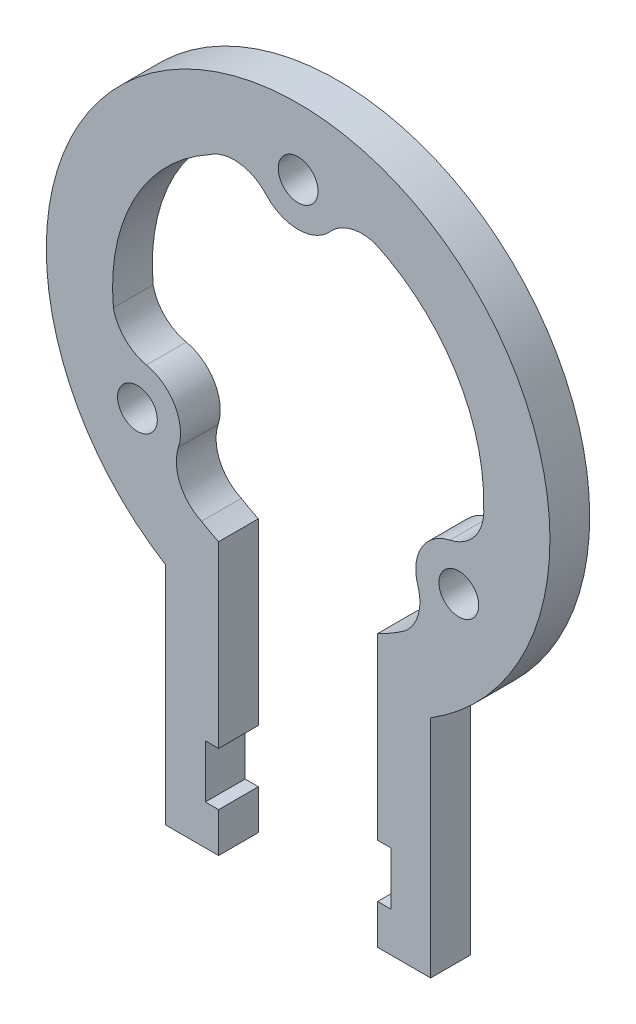
ISO-10303-21;
HEADER;
FILE_DESCRIPTION(('STEP AP214'),'2;1');
FILE_NAME('part.step','',(''),(''),'','','');
FILE_SCHEMA(('AUTOMOTIVE_DESIGN { 1 0 10303 214 1 1 1 1 }'));
ENDSEC;
DATA;
#1=APPLICATION_CONTEXT('core data for automotive mechanical design processes');
#2=APPLICATION_PROTOCOL_DEFINITION('international standard','automotive_design',2000,#1);
#3=PRODUCT_CONTEXT('',#1,'mechanical');
#4=PRODUCT('Part','Part','',(#3));
#5=PRODUCT_RELATED_PRODUCT_CATEGORY('part','',(#4));
#6=PRODUCT_DEFINITION_FORMATION('','',#4);
#7=PRODUCT_DEFINITION_CONTEXT('part definition',#1,'design');
#8=PRODUCT_DEFINITION('design','',#6,#7);
#9=PRODUCT_DEFINITION_SHAPE('','',#8);
#10=(LENGTH_UNIT() NAMED_UNIT(*) SI_UNIT(.MILLI.,.METRE.));
#11=(NAMED_UNIT(*) PLANE_ANGLE_UNIT() SI_UNIT($,.RADIAN.));
#12=(NAMED_UNIT(*) SI_UNIT($,.STERADIAN.) SOLID_ANGLE_UNIT());
#13=UNCERTAINTY_MEASURE_WITH_UNIT(LENGTH_MEASURE(1.E-05),#10,'distance_accuracy_value','');
#14=(GEOMETRIC_REPRESENTATION_CONTEXT(3) GLOBAL_UNCERTAINTY_ASSIGNED_CONTEXT((#13)) GLOBAL_UNIT_ASSIGNED_CONTEXT((#10,
#11,#12)) REPRESENTATION_CONTEXT('',''));
#15=CARTESIAN_POINT('',(0.,0.,0.));
#16=DIRECTION('',(0.,0.,1.));
#17=DIRECTION('',(1.,0.,0.));
#18=AXIS2_PLACEMENT_3D('',#15,#16,#17);
#19=CARTESIAN_POINT('',(0.,0.,3.));
#20=DIRECTION('',(0.,0.,1.));
#21=DIRECTION('',(1.,0.,0.));
#22=AXIS2_PLACEMENT_3D('',#19,#20,#21);
#23=PLANE('',#22);
#24=CARTESIAN_POINT('',(12.124355652982,-7.00000000000017,3.));
#25=DIRECTION('',(0.,0.,1.));
#26=DIRECTION('',(1.,0.,0.));
#27=AXIS2_PLACEMENT_3D('',#24,#25,#26);
#28=CIRCLE('',#27,1.50000000000007);
#29=CARTESIAN_POINT('',(13.6243556529821,-7.00000000000017,3.));
#30=VERTEX_POINT('',#29);
#31=EDGE_CURVE('E493',#30,#30,#28,.T.);
#32=ORIENTED_EDGE('',*,*,#31,.F.);
#33=EDGE_LOOP('',(#32));
#34=FACE_BOUND('',#33,.T.);
#35=DIRECTION('',(-1.,0.,0.));
#36=VECTOR('',#35,1.);
#37=CARTESIAN_POINT('',(-7.0000000000001,-30.1554944214036,3.));
#38=LINE('',#37,#36);
#39=CARTESIAN_POINT('',(-6.0000000000001,-30.1554944214036,3.));
#40=VERTEX_POINT('',#39);
#41=CARTESIAN_POINT('',(-7.0000000000001,-30.1554944214036,3.));
#42=VERTEX_POINT('',#41);
#43=EDGE_CURVE('E304',#40,#42,#38,.T.);
#44=ORIENTED_EDGE('',*,*,#43,.T.);
#45=DIRECTION('',(0.,1.,0.));
#46=VECTOR('',#45,1.);
#47=CARTESIAN_POINT('',(-7.00000000000009,-26.1554944214036,3.));
#48=LINE('',#47,#46);
#49=CARTESIAN_POINT('',(-7.00000000000009,-26.1554944214036,3.));
#50=VERTEX_POINT('',#49);
#51=EDGE_CURVE('E152',#42,#50,#48,.T.);
#52=ORIENTED_EDGE('',*,*,#51,.T.);
#53=DIRECTION('',(1.,0.,0.));
#54=VECTOR('',#53,1.);
#55=CARTESIAN_POINT('',(-7.00000000000009,-26.1554944214036,3.));
#56=LINE('',#55,#54);
#57=CARTESIAN_POINT('',(-6.00000000000009,-26.1554944214036,3.));
#58=VERTEX_POINT('',#57);
#59=EDGE_CURVE('E379',#50,#58,#56,.T.);
#60=ORIENTED_EDGE('',*,*,#59,.T.);
#61=DIRECTION('',(0.,1.,0.));
#62=VECTOR('',#61,1.);
#63=CARTESIAN_POINT('',(-6.00000000000009,-26.1554944214036,3.));
#64=LINE('',#63,#62);
#65=CARTESIAN_POINT('',(-6.0000000000001,-12.6491106406735,3.));
#66=VERTEX_POINT('',#65);
#67=EDGE_CURVE('E398',#58,#66,#64,.T.);
#68=ORIENTED_EDGE('',*,*,#67,.T.);
#69=CARTESIAN_POINT('',(0.,0.,3.));
#70=DIRECTION('',(0.,0.,-1.));
#71=DIRECTION('',(1.,0.,0.));
#72=AXIS2_PLACEMENT_3D('',#69,#70,#71);
#73=CIRCLE('',#72,14.);
#74=CARTESIAN_POINT('',(-7.28860608140232,-11.9530841789952,3.));
#75=VERTEX_POINT('',#74);
#76=EDGE_CURVE('E395',#66,#75,#73,.T.);
#77=ORIENTED_EDGE('',*,*,#76,.T.);
#78=CARTESIAN_POINT('',(-5.93863769378334,-8.99672064376658,3.));
#79=DIRECTION('',(0.,0.,-1.));
#80=DIRECTION('',(1.,0.,0.));
#81=AXIS2_PLACEMENT_3D('',#78,#79,#80);
#82=CIRCLE('',#81,3.25);
#83=CARTESIAN_POINT('',(-9.03149667338279,-7.9983603218832,3.));
#84=VERTEX_POINT('',#83);
#85=EDGE_CURVE('E397',#75,#84,#82,.T.);
#86=ORIENTED_EDGE('',*,*,#85,.T.);
#87=CARTESIAN_POINT('',(-12.1243556529822,-6.99999999999983,3.));
#88=DIRECTION('',(0.,0.,1.));
#89=DIRECTION('',(1.,0.,0.));
#90=AXIS2_PLACEMENT_3D('',#87,#88,#89);
#91=CIRCLE('',#90,3.25);
#92=CARTESIAN_POINT('',(-11.4425315640638,-3.82232539240223,3.));
#93=VERTEX_POINT('',#92);
#94=EDGE_CURVE('E400',#84,#93,#91,.T.);
#95=ORIENTED_EDGE('',*,*,#94,.T.);
#96=CARTESIAN_POINT('',(-10.7607074751454,-0.644650784804622,3.));
#97=DIRECTION('',(0.,0.,-1.));
#98=DIRECTION('',(1.,0.,0.));
#99=AXIS2_PLACEMENT_3D('',#96,#97,#98);
#100=CIRCLE('',#99,3.25);
#101=CARTESIAN_POINT('',(-13.9359386105091,-1.33776494352389,3.));
#102=VERTEX_POINT('',#101);
#103=EDGE_CURVE('E406',#93,#102,#100,.T.);
#104=ORIENTED_EDGE('',*,*,#103,.T.);
#105=CARTESIAN_POINT('',(0.,0.,3.));
#106=DIRECTION('',(0.,0.,-1.));
#107=DIRECTION('',(1.,0.,0.));
#108=AXIS2_PLACEMENT_3D('',#105,#106,#107);
#109=CIRCLE('',#108,14.);
#110=CARTESIAN_POINT('',(-6.70737151188253,12.2886601141698,3.));
#111=VERTEX_POINT('',#110);
#112=EDGE_CURVE('E408',#102,#111,#109,.T.);
#113=ORIENTED_EDGE('',*,*,#112,.T.);
#114=CARTESIAN_POINT('',(-4.82206978136206,9.6413714285715,3.));
#115=DIRECTION('',(0.,0.,-1.));
#116=DIRECTION('',(1.,0.,0.));
#117=AXIS2_PLACEMENT_3D('',#114,#115,#116);
#118=CIRCLE('',#117,3.25);
#119=CARTESIAN_POINT('',(-2.41103489068093,11.8206857142858,3.));
#120=VERTEX_POINT('',#119);
#121=EDGE_CURVE('E410',#111,#120,#118,.T.);
#122=ORIENTED_EDGE('',*,*,#121,.T.);
#123=CARTESIAN_POINT('',(2.07934408239977E-13,14.,3.));
#124=DIRECTION('',(0.,0.,1.));
#125=DIRECTION('',(1.,0.,0.));
#126=AXIS2_PLACEMENT_3D('',#123,#124,#125);
#127=CIRCLE('',#126,3.25);
#128=CARTESIAN_POINT('',(2.41103489068127,11.8206857142857,3.));
#129=VERTEX_POINT('',#128);
#130=EDGE_CURVE('E412',#120,#129,#127,.T.);
#131=ORIENTED_EDGE('',*,*,#130,.T.);
#132=CARTESIAN_POINT('',(4.82206978136234,9.64137142857136,3.));
#133=DIRECTION('',(0.,0.,-1.));
#134=DIRECTION('',(1.,0.,0.));
#135=AXIS2_PLACEMENT_3D('',#132,#133,#134);
#136=CIRCLE('',#135,3.25);
#137=CARTESIAN_POINT('',(5.80943087987061,12.7377593340432,3.));
#138=VERTEX_POINT('',#137);
#139=EDGE_CURVE('E414',#129,#138,#136,.T.);
#140=ORIENTED_EDGE('',*,*,#139,.T.);
#141=CARTESIAN_POINT('',(0.,0.,3.));
#142=DIRECTION('',(0.,0.,-1.));
#143=DIRECTION('',(1.,0.,0.));
#144=AXIS2_PLACEMENT_3D('',#141,#142,#143);
#145=CIRCLE('',#144,14.);
#146=CARTESIAN_POINT('',(13.9959775932849,-0.335575935174566,3.));
#147=VERTEX_POINT('',#146);
#148=EDGE_CURVE('E416',#138,#147,#145,.T.);
#149=ORIENTED_EDGE('',*,*,#148,.T.);
#150=CARTESIAN_POINT('',(10.7607074751454,-0.644650784804921,3.));
#151=DIRECTION('',(0.,0.,-1.));
#152=DIRECTION('',(1.,0.,0.));
#153=AXIS2_PLACEMENT_3D('',#150,#151,#152);
#154=CIRCLE('',#153,3.25);
#155=CARTESIAN_POINT('',(11.4425315640637,-3.82232539240255,3.));
#156=VERTEX_POINT('',#155);
#157=EDGE_CURVE('E418',#147,#156,#154,.T.);
#158=ORIENTED_EDGE('',*,*,#157,.T.);
#159=CARTESIAN_POINT('',(12.124355652982,-7.00000000000017,3.));
#160=DIRECTION('',(0.,0.,1.));
#161=DIRECTION('',(1.,0.,0.));
#162=AXIS2_PLACEMENT_3D('',#159,#160,#161);
#163=CIRCLE('',#162,3.25);
#164=CARTESIAN_POINT('',(9.03149667338257,-7.99836032188346,3.));
#165=VERTEX_POINT('',#164);
#166=EDGE_CURVE('E420',#156,#165,#163,.T.);
#167=ORIENTED_EDGE('',*,*,#166,.T.);
#168=CARTESIAN_POINT('',(5.93863769378309,-8.99672064376674,3.));
#169=DIRECTION('',(0.,0.,-1.));
#170=DIRECTION('',(1.,0.,0.));
#171=AXIS2_PLACEMENT_3D('',#168,#169,#170);
#172=CIRCLE('',#171,3.25);
#173=CARTESIAN_POINT('',(8.12650773063849,-11.3999943905194,3.));
#174=VERTEX_POINT('',#173);
#175=EDGE_CURVE('E422',#165,#174,#172,.T.);
#176=ORIENTED_EDGE('',*,*,#175,.T.);
#177=CARTESIAN_POINT('',(0.,0.,3.));
#178=DIRECTION('',(0.,0.,-1.));
#179=DIRECTION('',(1.,0.,0.));
#180=AXIS2_PLACEMENT_3D('',#177,#178,#179);
#181=CIRCLE('',#180,14.);
#182=CARTESIAN_POINT('',(5.9999999999999,-12.6491106406736,3.));
#183=VERTEX_POINT('',#182);
#184=EDGE_CURVE('E424',#174,#183,#181,.T.);
#185=ORIENTED_EDGE('',*,*,#184,.T.);
#186=DIRECTION('',(0.,-1.,0.));
#187=VECTOR('',#186,1.);
#188=CARTESIAN_POINT('',(5.99999999999991,-26.1554944214036,3.));
#189=LINE('',#188,#187);
#190=CARTESIAN_POINT('',(5.99999999999991,-26.1554944214036,3.));
#191=VERTEX_POINT('',#190);
#192=EDGE_CURVE('E426',#183,#191,#189,.T.);
#193=ORIENTED_EDGE('',*,*,#192,.T.);
#194=DIRECTION('',(1.,0.,0.));
#195=VECTOR('',#194,1.);
#196=CARTESIAN_POINT('',(5.99999999999991,-26.1554944214036,3.));
#197=LINE('',#196,#195);
#198=CARTESIAN_POINT('',(6.99999999999991,-26.1554944214036,3.));
#199=VERTEX_POINT('',#198);
#200=EDGE_CURVE('E428',#191,#199,#197,.T.);
#201=ORIENTED_EDGE('',*,*,#200,.T.);
#202=DIRECTION('',(0.,-1.,0.));
#203=VECTOR('',#202,1.);
#204=CARTESIAN_POINT('',(6.99999999999991,-26.1554944214036,3.));
#205=LINE('',#204,#203);
#206=CARTESIAN_POINT('',(6.9999999999999,-30.1554944214036,3.));
#207=VERTEX_POINT('',#206);
#208=EDGE_CURVE('E430',#199,#207,#205,.T.);
#209=ORIENTED_EDGE('',*,*,#208,.T.);
#210=DIRECTION('',(-1.,0.,0.));
#211=VECTOR('',#210,1.);
#212=CARTESIAN_POINT('',(5.9999999999999,-30.1554944214036,3.));
#213=LINE('',#212,#211);
#214=CARTESIAN_POINT('',(5.9999999999999,-30.1554944214036,3.));
#215=VERTEX_POINT('',#214);
#216=EDGE_CURVE('E432',#207,#215,#213,.T.);
#217=ORIENTED_EDGE('',*,*,#216,.T.);
#218=DIRECTION('',(0.,-1.,0.));
#219=VECTOR('',#218,1.);
#220=CARTESIAN_POINT('',(5.9999999999999,-33.1554944214036,3.));
#221=LINE('',#220,#219);
#222=CARTESIAN_POINT('',(5.9999999999999,-33.1554944214036,3.));
#223=VERTEX_POINT('',#222);
#224=EDGE_CURVE('E434',#215,#223,#221,.T.);
#225=ORIENTED_EDGE('',*,*,#224,.T.);
#226=DIRECTION('',(1.,0.,0.));
#227=VECTOR('',#226,1.);
#228=CARTESIAN_POINT('',(9.9999999999999,-33.1554944214036,3.));
#229=LINE('',#228,#227);
#230=CARTESIAN_POINT('',(9.9999999999999,-33.1554944214036,3.));
#231=VERTEX_POINT('',#230);
#232=EDGE_CURVE('E436',#223,#231,#229,.T.);
#233=ORIENTED_EDGE('',*,*,#232,.T.);
#234=DIRECTION('',(0.,1.,0.));
#235=VECTOR('',#234,1.);
#236=CARTESIAN_POINT('',(9.9999999999999,-16.1554944214036,3.));
#237=LINE('',#236,#235);
#238=CARTESIAN_POINT('',(9.9999999999999,-16.1554944214036,3.));
#239=VERTEX_POINT('',#238);
#240=EDGE_CURVE('E438',#231,#239,#237,.T.);
#241=ORIENTED_EDGE('',*,*,#240,.T.);
#242=CARTESIAN_POINT('',(0.,0.,3.));
#243=DIRECTION('',(0.,0.,1.));
#244=DIRECTION('',(1.,0.,0.));
#245=AXIS2_PLACEMENT_3D('',#242,#243,#244);
#246=CIRCLE('',#245,19.);
#247=CARTESIAN_POINT('',(-10.0000000000001,-16.1554944214034,3.));
#248=VERTEX_POINT('',#247);
#249=EDGE_CURVE('E231',#239,#248,#246,.T.);
#250=ORIENTED_EDGE('',*,*,#249,.T.);
#251=DIRECTION('',(0.,-1.,0.));
#252=VECTOR('',#251,1.);
#253=CARTESIAN_POINT('',(-10.0000000000001,-16.1554944214034,3.));
#254=LINE('',#253,#252);
#255=CARTESIAN_POINT('',(-10.0000000000001,-33.1554944214036,3.));
#256=VERTEX_POINT('',#255);
#257=EDGE_CURVE('E225',#248,#256,#254,.T.);
#258=ORIENTED_EDGE('',*,*,#257,.T.);
#259=DIRECTION('',(1.,0.,0.));
#260=VECTOR('',#259,1.);
#261=CARTESIAN_POINT('',(-6.0000000000001,-33.1554944214036,3.));
#262=LINE('',#261,#260);
#263=CARTESIAN_POINT('',(-6.0000000000001,-33.1554944214036,3.));
#264=VERTEX_POINT('',#263);
#265=EDGE_CURVE('E229',#256,#264,#262,.T.);
#266=ORIENTED_EDGE('',*,*,#265,.T.);
#267=DIRECTION('',(0.,1.,0.));
#268=VECTOR('',#267,1.);
#269=CARTESIAN_POINT('',(-6.0000000000001,-33.1554944214036,3.));
#270=LINE('',#269,#268);
#271=EDGE_CURVE('E49',#264,#40,#270,.T.);
#272=ORIENTED_EDGE('',*,*,#271,.T.);
#273=EDGE_LOOP('',(#44,#52,#60,#68,#77,#86,#95,#104,#113,#122,#131,#140,#149,#158,#167,#176,
#185,#193,#201,#209,#217,#225,#233,#241,#250,#258,#266,#272));
#274=FACE_BOUND('',#273,.T.);
#275=CARTESIAN_POINT('',(2.07934408239977E-13,14.,3.));
#276=DIRECTION('',(0.,0.,1.));
#277=DIRECTION('',(1.,0.,0.));
#278=AXIS2_PLACEMENT_3D('',#275,#276,#277);
#279=CIRCLE('',#278,1.5);
#280=CARTESIAN_POINT('',(1.50000000000021,14.,3.));
#281=VERTEX_POINT('',#280);
#282=EDGE_CURVE('E253',#281,#281,#279,.T.);
#283=ORIENTED_EDGE('',*,*,#282,.F.);
#284=EDGE_LOOP('',(#283));
#285=FACE_BOUND('',#284,.T.);
#286=CARTESIAN_POINT('',(-12.1243556529822,-6.99999999999983,3.));
#287=DIRECTION('',(0.,0.,1.));
#288=DIRECTION('',(1.,0.,0.));
#289=AXIS2_PLACEMENT_3D('',#286,#287,#288);
#290=CIRCLE('',#289,1.5);
#291=CARTESIAN_POINT('',(-10.6243556529822,-6.99999999999983,3.));
#292=VERTEX_POINT('',#291);
#293=EDGE_CURVE('E484',#292,#292,#290,.T.);
#294=ORIENTED_EDGE('',*,*,#293,.F.);
#295=EDGE_LOOP('',(#294));
#296=FACE_BOUND('',#295,.T.);
#297=ADVANCED_FACE('F32',(#34,#274,#285,#296),#23,.T.);
#298=CARTESIAN_POINT('',(0.,0.,0.));
#299=DIRECTION('',(0.,0.,1.));
#300=DIRECTION('',(1.,0.,0.));
#301=AXIS2_PLACEMENT_3D('',#298,#299,#300);
#302=PLANE('',#301);
#303=DIRECTION('',(-1.,0.,0.));
#304=VECTOR('',#303,1.);
#305=CARTESIAN_POINT('',(-7.0000000000001,-30.1554944214036,0.));
#306=LINE('',#305,#304);
#307=CARTESIAN_POINT('',(-6.0000000000001,-30.1554944214036,0.));
#308=VERTEX_POINT('',#307);
#309=CARTESIAN_POINT('',(-7.0000000000001,-30.1554944214036,0.));
#310=VERTEX_POINT('',#309);
#311=EDGE_CURVE('E249',#308,#310,#306,.T.);
#312=ORIENTED_EDGE('',*,*,#311,.F.);
#313=DIRECTION('',(0.,1.,0.));
#314=VECTOR('',#313,1.);
#315=CARTESIAN_POINT('',(-6.0000000000001,-33.1554944214036,0.));
#316=LINE('',#315,#314);
#317=CARTESIAN_POINT('',(-6.0000000000001,-33.1554944214036,0.));
#318=VERTEX_POINT('',#317);
#319=EDGE_CURVE('E144',#318,#308,#316,.T.);
#320=ORIENTED_EDGE('',*,*,#319,.F.);
#321=DIRECTION('',(1.,0.,0.));
#322=VECTOR('',#321,1.);
#323=CARTESIAN_POINT('',(-6.0000000000001,-33.1554944214036,0.));
#324=LINE('',#323,#322);
#325=CARTESIAN_POINT('',(-10.0000000000001,-33.1554944214036,0.));
#326=VERTEX_POINT('',#325);
#327=EDGE_CURVE('E138',#326,#318,#324,.T.);
#328=ORIENTED_EDGE('',*,*,#327,.F.);
#329=DIRECTION('',(0.,-1.,0.));
#330=VECTOR('',#329,1.);
#331=CARTESIAN_POINT('',(-10.0000000000001,-16.1554944214034,0.));
#332=LINE('',#331,#330);
#333=CARTESIAN_POINT('',(-10.0000000000001,-16.1554944214034,0.));
#334=VERTEX_POINT('',#333);
#335=EDGE_CURVE('E239',#334,#326,#332,.T.);
#336=ORIENTED_EDGE('',*,*,#335,.F.);
#337=CARTESIAN_POINT('',(0.,0.,0.));
#338=DIRECTION('',(0.,0.,1.));
#339=DIRECTION('',(1.,0.,0.));
#340=AXIS2_PLACEMENT_3D('',#337,#338,#339);
#341=CIRCLE('',#340,19.);
#342=CARTESIAN_POINT('',(9.9999999999999,-16.1554944214036,0.));
#343=VERTEX_POINT('',#342);
#344=EDGE_CURVE('E299',#343,#334,#341,.T.);
#345=ORIENTED_EDGE('',*,*,#344,.F.);
#346=DIRECTION('',(0.,1.,0.));
#347=VECTOR('',#346,1.);
#348=CARTESIAN_POINT('',(9.9999999999999,-16.1554944214036,0.));
#349=LINE('',#348,#347);
#350=CARTESIAN_POINT('',(9.9999999999999,-33.1554944214036,0.));
#351=VERTEX_POINT('',#350);
#352=EDGE_CURVE('E297',#351,#343,#349,.T.);
#353=ORIENTED_EDGE('',*,*,#352,.F.);
#354=DIRECTION('',(1.,0.,0.));
#355=VECTOR('',#354,1.);
#356=CARTESIAN_POINT('',(9.9999999999999,-33.1554944214036,0.));
#357=LINE('',#356,#355);
#358=CARTESIAN_POINT('',(5.9999999999999,-33.1554944214036,0.));
#359=VERTEX_POINT('',#358);
#360=EDGE_CURVE('E295',#359,#351,#357,.T.);
#361=ORIENTED_EDGE('',*,*,#360,.F.);
#362=DIRECTION('',(0.,-1.,0.));
#363=VECTOR('',#362,1.);
#364=CARTESIAN_POINT('',(5.9999999999999,-33.1554944214036,0.));
#365=LINE('',#364,#363);
#366=CARTESIAN_POINT('',(5.9999999999999,-30.1554944214036,0.));
#367=VERTEX_POINT('',#366);
#368=EDGE_CURVE('E293',#367,#359,#365,.T.);
#369=ORIENTED_EDGE('',*,*,#368,.F.);
#370=DIRECTION('',(-1.,0.,0.));
#371=VECTOR('',#370,1.);
#372=CARTESIAN_POINT('',(5.9999999999999,-30.1554944214036,0.));
#373=LINE('',#372,#371);
#374=CARTESIAN_POINT('',(6.9999999999999,-30.1554944214036,0.));
#375=VERTEX_POINT('',#374);
#376=EDGE_CURVE('E291',#375,#367,#373,.T.);
#377=ORIENTED_EDGE('',*,*,#376,.F.);
#378=DIRECTION('',(0.,-1.,0.));
#379=VECTOR('',#378,1.);
#380=CARTESIAN_POINT('',(6.99999999999991,-26.1554944214036,0.));
#381=LINE('',#380,#379);
#382=CARTESIAN_POINT('',(6.99999999999991,-26.1554944214036,0.));
#383=VERTEX_POINT('',#382);
#384=EDGE_CURVE('E289',#383,#375,#381,.T.);
#385=ORIENTED_EDGE('',*,*,#384,.F.);
#386=DIRECTION('',(1.,0.,0.));
#387=VECTOR('',#386,1.);
#388=CARTESIAN_POINT('',(5.99999999999991,-26.1554944214036,0.));
#389=LINE('',#388,#387);
#390=CARTESIAN_POINT('',(5.99999999999991,-26.1554944214036,0.));
#391=VERTEX_POINT('',#390);
#392=EDGE_CURVE('E287',#391,#383,#389,.T.);
#393=ORIENTED_EDGE('',*,*,#392,.F.);
#394=DIRECTION('',(0.,-1.,0.));
#395=VECTOR('',#394,1.);
#396=CARTESIAN_POINT('',(5.99999999999991,-26.1554944214036,0.));
#397=LINE('',#396,#395);
#398=CARTESIAN_POINT('',(5.9999999999999,-12.6491106406736,0.));
#399=VERTEX_POINT('',#398);
#400=EDGE_CURVE('E285',#399,#391,#397,.T.);
#401=ORIENTED_EDGE('',*,*,#400,.F.);
#402=CARTESIAN_POINT('',(0.,0.,0.));
#403=DIRECTION('',(0.,0.,-1.));
#404=DIRECTION('',(1.,0.,0.));
#405=AXIS2_PLACEMENT_3D('',#402,#403,#404);
#406=CIRCLE('',#405,14.);
#407=CARTESIAN_POINT('',(8.12650773063849,-11.3999943905194,0.));
#408=VERTEX_POINT('',#407);
#409=EDGE_CURVE('E283',#408,#399,#406,.T.);
#410=ORIENTED_EDGE('',*,*,#409,.F.);
#411=CARTESIAN_POINT('',(5.93863769378309,-8.99672064376674,0.));
#412=DIRECTION('',(0.,0.,-1.));
#413=DIRECTION('',(1.,0.,0.));
#414=AXIS2_PLACEMENT_3D('',#411,#412,#413);
#415=CIRCLE('',#414,3.25);
#416=CARTESIAN_POINT('',(9.03149667338257,-7.99836032188346,0.));
#417=VERTEX_POINT('',#416);
#418=EDGE_CURVE('E281',#417,#408,#415,.T.);
#419=ORIENTED_EDGE('',*,*,#418,.F.);
#420=CARTESIAN_POINT('',(12.124355652982,-7.00000000000017,0.));
#421=DIRECTION('',(0.,0.,1.));
#422=DIRECTION('',(1.,0.,0.));
#423=AXIS2_PLACEMENT_3D('',#420,#421,#422);
#424=CIRCLE('',#423,3.25);
#425=CARTESIAN_POINT('',(11.4425315640637,-3.82232539240255,0.));
#426=VERTEX_POINT('',#425);
#427=EDGE_CURVE('E279',#426,#417,#424,.T.);
#428=ORIENTED_EDGE('',*,*,#427,.F.);
#429=CARTESIAN_POINT('',(10.7607074751454,-0.644650784804921,0.));
#430=DIRECTION('',(0.,0.,-1.));
#431=DIRECTION('',(1.,0.,0.));
#432=AXIS2_PLACEMENT_3D('',#429,#430,#431);
#433=CIRCLE('',#432,3.25);
#434=CARTESIAN_POINT('',(13.9959775932849,-0.335575935174566,0.));
#435=VERTEX_POINT('',#434);
#436=EDGE_CURVE('E277',#435,#426,#433,.T.);
#437=ORIENTED_EDGE('',*,*,#436,.F.);
#438=CARTESIAN_POINT('',(0.,0.,0.));
#439=DIRECTION('',(0.,0.,-1.));
#440=DIRECTION('',(1.,0.,0.));
#441=AXIS2_PLACEMENT_3D('',#438,#439,#440);
#442=CIRCLE('',#441,14.);
#443=CARTESIAN_POINT('',(5.80943087987061,12.7377593340432,0.));
#444=VERTEX_POINT('',#443);
#445=EDGE_CURVE('E275',#444,#435,#442,.T.);
#446=ORIENTED_EDGE('',*,*,#445,.F.);
#447=CARTESIAN_POINT('',(4.82206978136234,9.64137142857136,0.));
#448=DIRECTION('',(0.,0.,-1.));
#449=DIRECTION('',(1.,0.,0.));
#450=AXIS2_PLACEMENT_3D('',#447,#448,#449);
#451=CIRCLE('',#450,3.25);
#452=CARTESIAN_POINT('',(2.41103489068127,11.8206857142857,0.));
#453=VERTEX_POINT('',#452);
#454=EDGE_CURVE('E273',#453,#444,#451,.T.);
#455=ORIENTED_EDGE('',*,*,#454,.F.);
#456=CARTESIAN_POINT('',(2.07934408239977E-13,14.,0.));
#457=DIRECTION('',(0.,0.,1.));
#458=DIRECTION('',(1.,0.,0.));
#459=AXIS2_PLACEMENT_3D('',#456,#457,#458);
#460=CIRCLE('',#459,3.25);
#461=CARTESIAN_POINT('',(-2.41103489068093,11.8206857142858,0.));
#462=VERTEX_POINT('',#461);
#463=EDGE_CURVE('E271',#462,#453,#460,.T.);
#464=ORIENTED_EDGE('',*,*,#463,.F.);
#465=CARTESIAN_POINT('',(-4.82206978136206,9.6413714285715,0.));
#466=DIRECTION('',(0.,0.,-1.));
#467=DIRECTION('',(1.,0.,0.));
#468=AXIS2_PLACEMENT_3D('',#465,#466,#467);
#469=CIRCLE('',#468,3.25);
#470=CARTESIAN_POINT('',(-6.70737151188253,12.2886601141698,0.));
#471=VERTEX_POINT('',#470);
#472=EDGE_CURVE('E269',#471,#462,#469,.T.);
#473=ORIENTED_EDGE('',*,*,#472,.F.);
#474=CARTESIAN_POINT('',(0.,0.,0.));
#475=DIRECTION('',(0.,0.,-1.));
#476=DIRECTION('',(1.,0.,0.));
#477=AXIS2_PLACEMENT_3D('',#474,#475,#476);
#478=CIRCLE('',#477,14.);
#479=CARTESIAN_POINT('',(-13.9359386105091,-1.33776494352389,0.));
#480=VERTEX_POINT('',#479);
#481=EDGE_CURVE('E267',#480,#471,#478,.T.);
#482=ORIENTED_EDGE('',*,*,#481,.F.);
#483=CARTESIAN_POINT('',(-10.7607074751454,-0.644650784804622,0.));
#484=DIRECTION('',(0.,0.,-1.));
#485=DIRECTION('',(1.,0.,0.));
#486=AXIS2_PLACEMENT_3D('',#483,#484,#485);
#487=CIRCLE('',#486,3.25);
#488=CARTESIAN_POINT('',(-11.4425315640638,-3.82232539240223,0.));
#489=VERTEX_POINT('',#488);
#490=EDGE_CURVE('E265',#489,#480,#487,.T.);
#491=ORIENTED_EDGE('',*,*,#490,.F.);
#492=CARTESIAN_POINT('',(-12.1243556529822,-6.99999999999983,0.));
#493=DIRECTION('',(0.,0.,1.));
#494=DIRECTION('',(1.,0.,0.));
#495=AXIS2_PLACEMENT_3D('',#492,#493,#494);
#496=CIRCLE('',#495,3.25);
#497=CARTESIAN_POINT('',(-9.03149667338279,-7.9983603218832,0.));
#498=VERTEX_POINT('',#497);
#499=EDGE_CURVE('E263',#498,#489,#496,.T.);
#500=ORIENTED_EDGE('',*,*,#499,.F.);
#501=CARTESIAN_POINT('',(-5.93863769378334,-8.99672064376658,0.));
#502=DIRECTION('',(0.,0.,-1.));
#503=DIRECTION('',(1.,0.,0.));
#504=AXIS2_PLACEMENT_3D('',#501,#502,#503);
#505=CIRCLE('',#504,3.25);
#506=CARTESIAN_POINT('',(-7.28860608140232,-11.9530841789952,0.));
#507=VERTEX_POINT('',#506);
#508=EDGE_CURVE('E261',#507,#498,#505,.T.);
#509=ORIENTED_EDGE('',*,*,#508,.F.);
#510=CARTESIAN_POINT('',(0.,0.,0.));
#511=DIRECTION('',(0.,0.,-1.));
#512=DIRECTION('',(1.,0.,0.));
#513=AXIS2_PLACEMENT_3D('',#510,#511,#512);
#514=CIRCLE('',#513,14.);
#515=CARTESIAN_POINT('',(-6.0000000000001,-12.6491106406735,0.));
#516=VERTEX_POINT('',#515);
#517=EDGE_CURVE('E259',#516,#507,#514,.T.);
#518=ORIENTED_EDGE('',*,*,#517,.F.);
#519=DIRECTION('',(0.,1.,0.));
#520=VECTOR('',#519,1.);
#521=CARTESIAN_POINT('',(-6.00000000000009,-26.1554944214036,0.));
#522=LINE('',#521,#520);
#523=CARTESIAN_POINT('',(-6.00000000000009,-26.1554944214036,0.));
#524=VERTEX_POINT('',#523);
#525=EDGE_CURVE('E257',#524,#516,#522,.T.);
#526=ORIENTED_EDGE('',*,*,#525,.F.);
#527=DIRECTION('',(1.,0.,0.));
#528=VECTOR('',#527,1.);
#529=CARTESIAN_POINT('',(-7.00000000000009,-26.1554944214036,0.));
#530=LINE('',#529,#528);
#531=CARTESIAN_POINT('',(-7.00000000000009,-26.1554944214036,0.));
#532=VERTEX_POINT('',#531);
#533=EDGE_CURVE('E255',#532,#524,#530,.T.);
#534=ORIENTED_EDGE('',*,*,#533,.F.);
#535=DIRECTION('',(0.,1.,0.));
#536=VECTOR('',#535,1.);
#537=CARTESIAN_POINT('',(-7.00000000000009,-26.1554944214036,0.));
#538=LINE('',#537,#536);
#539=EDGE_CURVE('E252',#310,#532,#538,.T.);
#540=ORIENTED_EDGE('',*,*,#539,.F.);
#541=EDGE_LOOP('',(#312,#320,#328,#336,#345,#353,#361,#369,#377,#385,#393,#401,#410,#419,#428,
#437,#446,#455,#464,#473,#482,#491,#500,#509,#518,#526,#534,#540));
#542=FACE_BOUND('',#541,.T.);
#543=CARTESIAN_POINT('',(2.07934408239977E-13,14.,0.));
#544=DIRECTION('',(0.,0.,1.));
#545=DIRECTION('',(1.,0.,0.));
#546=AXIS2_PLACEMENT_3D('',#543,#544,#545);
#547=CIRCLE('',#546,1.5);
#548=CARTESIAN_POINT('',(1.50000000000021,14.,0.));
#549=VERTEX_POINT('',#548);
#550=EDGE_CURVE('E496',#549,#549,#547,.T.);
#551=ORIENTED_EDGE('',*,*,#550,.T.);
#552=EDGE_LOOP('',(#551));
#553=FACE_BOUND('',#552,.T.);
#554=CARTESIAN_POINT('',(12.124355652982,-7.00000000000017,0.));
#555=DIRECTION('',(0.,0.,1.));
#556=DIRECTION('',(1.,0.,0.));
#557=AXIS2_PLACEMENT_3D('',#554,#555,#556);
#558=CIRCLE('',#557,1.50000000000007);
#559=CARTESIAN_POINT('',(13.6243556529821,-7.00000000000017,0.));
#560=VERTEX_POINT('',#559);
#561=EDGE_CURVE('E490',#560,#560,#558,.T.);
#562=ORIENTED_EDGE('',*,*,#561,.T.);
#563=EDGE_LOOP('',(#562));
#564=FACE_BOUND('',#563,.T.);
#565=CARTESIAN_POINT('',(-12.1243556529822,-6.99999999999983,0.));
#566=DIRECTION('',(0.,0.,1.));
#567=DIRECTION('',(1.,0.,0.));
#568=AXIS2_PLACEMENT_3D('',#565,#566,#567);
#569=CIRCLE('',#568,1.5);
#570=CARTESIAN_POINT('',(-10.6243556529822,-6.99999999999983,0.));
#571=VERTEX_POINT('',#570);
#572=EDGE_CURVE('E487',#571,#571,#569,.T.);
#573=ORIENTED_EDGE('',*,*,#572,.T.);
#574=EDGE_LOOP('',(#573));
#575=FACE_BOUND('',#574,.T.);
#576=ADVANCED_FACE('F383',(#542,#553,#564,#575),#302,.F.);
#577=CARTESIAN_POINT('',(-7.0000000000001,-30.1554944214036,3.));
#578=DIRECTION('',(0.,-1.,0.));
#579=DIRECTION('',(0.,0.,-1.));
#580=AXIS2_PLACEMENT_3D('',#577,#578,#579);
#581=PLANE('',#580);
#582=ORIENTED_EDGE('',*,*,#311,.T.);
#583=DIRECTION('',(0.,0.,-1.));
#584=VECTOR('',#583,1.);
#585=CARTESIAN_POINT('',(-7.0000000000001,-30.1554944214036,3.));
#586=LINE('',#585,#584);
#587=EDGE_CURVE('E11',#42,#310,#586,.T.);
#588=ORIENTED_EDGE('',*,*,#587,.F.);
#589=ORIENTED_EDGE('',*,*,#43,.F.);
#590=DIRECTION('',(0.,0.,-1.));
#591=VECTOR('',#590,1.);
#592=CARTESIAN_POINT('',(-6.0000000000001,-30.1554944214036,3.));
#593=LINE('',#592,#591);
#594=EDGE_CURVE('E245',#40,#308,#593,.T.);
#595=ORIENTED_EDGE('',*,*,#594,.T.);
#596=EDGE_LOOP('',(#582,#588,#589,#595));
#597=FACE_BOUND('',#596,.T.);
#598=ADVANCED_FACE('F34',(#597),#581,.F.);
#599=CARTESIAN_POINT('',(-7.00000000000009,-26.1554944214036,3.));
#600=DIRECTION('',(-1.,0.,0.));
#601=DIRECTION('',(0.,-1.,0.));
#602=AXIS2_PLACEMENT_3D('',#599,#600,#601);
#603=PLANE('',#602);
#604=ORIENTED_EDGE('',*,*,#539,.T.);
#605=DIRECTION('',(0.,0.,-1.));
#606=VECTOR('',#605,1.);
#607=CARTESIAN_POINT('',(-7.00000000000009,-26.1554944214036,3.));
#608=LINE('',#607,#606);
#609=EDGE_CURVE('E41',#50,#532,#608,.T.);
#610=ORIENTED_EDGE('',*,*,#609,.F.);
#611=ORIENTED_EDGE('',*,*,#51,.F.);
#612=ORIENTED_EDGE('',*,*,#587,.T.);
#613=EDGE_LOOP('',(#604,#610,#611,#612));
#614=FACE_BOUND('',#613,.T.);
#615=ADVANCED_FACE('F758',(#614),#603,.F.);
#616=CARTESIAN_POINT('',(-7.00000000000009,-26.1554944214036,3.));
#617=DIRECTION('',(0.,1.,0.));
#618=DIRECTION('',(0.,0.,1.));
#619=AXIS2_PLACEMENT_3D('',#616,#617,#618);
#620=PLANE('',#619);
#621=ORIENTED_EDGE('',*,*,#533,.T.);
#622=DIRECTION('',(0.,0.,-1.));
#623=VECTOR('',#622,1.);
#624=CARTESIAN_POINT('',(-6.00000000000009,-26.1554944214036,3.));
#625=LINE('',#624,#623);
#626=EDGE_CURVE('E371',#58,#524,#625,.T.);
#627=ORIENTED_EDGE('',*,*,#626,.F.);
#628=ORIENTED_EDGE('',*,*,#59,.F.);
#629=ORIENTED_EDGE('',*,*,#609,.T.);
#630=EDGE_LOOP('',(#621,#627,#628,#629));
#631=FACE_BOUND('',#630,.T.);
#632=ADVANCED_FACE('F377',(#631),#620,.F.);
#633=CARTESIAN_POINT('',(-6.00000000000009,-26.1554944214036,3.));
#634=DIRECTION('',(-1.,0.,0.));
#635=DIRECTION('',(0.,-1.,0.));
#636=AXIS2_PLACEMENT_3D('',#633,#634,#635);
#637=PLANE('',#636);
#638=ORIENTED_EDGE('',*,*,#525,.T.);
#639=DIRECTION('',(0.,0.,-1.));
#640=VECTOR('',#639,1.);
#641=CARTESIAN_POINT('',(-6.0000000000001,-12.6491106406735,3.));
#642=LINE('',#641,#640);
#643=EDGE_CURVE('E368',#66,#516,#642,.T.);
#644=ORIENTED_EDGE('',*,*,#643,.F.);
#645=ORIENTED_EDGE('',*,*,#67,.F.);
#646=ORIENTED_EDGE('',*,*,#626,.T.);
#647=EDGE_LOOP('',(#638,#644,#645,#646));
#648=FACE_BOUND('',#647,.T.);
#649=ADVANCED_FACE('F389',(#648),#637,.F.);
#650=CARTESIAN_POINT('',(0.,0.,3.));
#651=DIRECTION('',(0.,0.,-1.));
#652=DIRECTION('',(-1.,0.,0.));
#653=AXIS2_PLACEMENT_3D('',#650,#651,#652);
#654=CYLINDRICAL_SURFACE('',#653,14.);
#655=ORIENTED_EDGE('',*,*,#517,.T.);
#656=DIRECTION('',(0.,0.,-1.));
#657=VECTOR('',#656,1.);
#658=CARTESIAN_POINT('',(-7.28860608140232,-11.9530841789952,3.));
#659=LINE('',#658,#657);
#660=EDGE_CURVE('E365',#75,#507,#659,.T.);
#661=ORIENTED_EDGE('',*,*,#660,.F.);
#662=ORIENTED_EDGE('',*,*,#76,.F.);
#663=ORIENTED_EDGE('',*,*,#643,.T.);
#664=EDGE_LOOP('',(#655,#661,#662,#663));
#665=FACE_BOUND('',#664,.T.);
#666=ADVANCED_FACE('F393',(#665),#654,.F.);
#667=CARTESIAN_POINT('',(-5.93863769378334,-8.99672064376658,3.));
#668=DIRECTION('',(0.,0.,-1.));
#669=DIRECTION('',(-1.,0.,0.));
#670=AXIS2_PLACEMENT_3D('',#667,#668,#669);
#671=CYLINDRICAL_SURFACE('',#670,3.25);
#672=ORIENTED_EDGE('',*,*,#508,.T.);
#673=DIRECTION('',(0.,0.,-1.));
#674=VECTOR('',#673,1.);
#675=CARTESIAN_POINT('',(-9.03149667338279,-7.9983603218832,3.));
#676=LINE('',#675,#674);
#677=EDGE_CURVE('E362',#84,#498,#676,.T.);
#678=ORIENTED_EDGE('',*,*,#677,.F.);
#679=ORIENTED_EDGE('',*,*,#85,.F.);
#680=ORIENTED_EDGE('',*,*,#660,.T.);
#681=EDGE_LOOP('',(#672,#678,#679,#680));
#682=FACE_BOUND('',#681,.T.);
#683=ADVANCED_FACE('F723',(#682),#671,.F.);
#684=CARTESIAN_POINT('',(-12.1243556529822,-6.99999999999983,3.));
#685=DIRECTION('',(0.,0.,-1.));
#686=DIRECTION('',(-1.,0.,0.));
#687=AXIS2_PLACEMENT_3D('',#684,#685,#686);
#688=CYLINDRICAL_SURFACE('',#687,3.25);
#689=ORIENTED_EDGE('',*,*,#499,.T.);
#690=DIRECTION('',(0.,0.,-1.));
#691=VECTOR('',#690,1.);
#692=CARTESIAN_POINT('',(-11.4425315640638,-3.82232539240223,3.));
#693=LINE('',#692,#691);
#694=EDGE_CURVE('E359',#93,#489,#693,.T.);
#695=ORIENTED_EDGE('',*,*,#694,.F.);
#696=ORIENTED_EDGE('',*,*,#94,.F.);
#697=ORIENTED_EDGE('',*,*,#677,.T.);
#698=EDGE_LOOP('',(#689,#695,#696,#697));
#699=FACE_BOUND('',#698,.T.);
#700=ADVANCED_FACE('F713',(#699),#688,.T.);
#701=CARTESIAN_POINT('',(-10.7607074751454,-0.644650784804622,3.));
#702=DIRECTION('',(0.,0.,-1.));
#703=DIRECTION('',(-1.,0.,0.));
#704=AXIS2_PLACEMENT_3D('',#701,#702,#703);
#705=CYLINDRICAL_SURFACE('',#704,3.25);
#706=ORIENTED_EDGE('',*,*,#490,.T.);
#707=DIRECTION('',(0.,0.,-1.));
#708=VECTOR('',#707,1.);
#709=CARTESIAN_POINT('',(-13.9359386105091,-1.33776494352389,3.));
#710=LINE('',#709,#708);
#711=EDGE_CURVE('E356',#102,#480,#710,.T.);
#712=ORIENTED_EDGE('',*,*,#711,.F.);
#713=ORIENTED_EDGE('',*,*,#103,.F.);
#714=ORIENTED_EDGE('',*,*,#694,.T.);
#715=EDGE_LOOP('',(#706,#712,#713,#714));
#716=FACE_BOUND('',#715,.T.);
#717=ADVANCED_FACE('F703',(#716),#705,.F.);
#718=CARTESIAN_POINT('',(0.,0.,3.));
#719=DIRECTION('',(0.,0.,-1.));
#720=DIRECTION('',(-1.,0.,0.));
#721=AXIS2_PLACEMENT_3D('',#718,#719,#720);
#722=CYLINDRICAL_SURFACE('',#721,14.);
#723=ORIENTED_EDGE('',*,*,#481,.T.);
#724=DIRECTION('',(0.,0.,-1.));
#725=VECTOR('',#724,1.);
#726=CARTESIAN_POINT('',(-6.70737151188253,12.2886601141698,3.));
#727=LINE('',#726,#725);
#728=EDGE_CURVE('E353',#111,#471,#727,.T.);
#729=ORIENTED_EDGE('',*,*,#728,.F.);
#730=ORIENTED_EDGE('',*,*,#112,.F.);
#731=ORIENTED_EDGE('',*,*,#711,.T.);
#732=EDGE_LOOP('',(#723,#729,#730,#731));
#733=FACE_BOUND('',#732,.T.);
#734=ADVANCED_FACE('F693',(#733),#722,.F.);
#735=CARTESIAN_POINT('',(-4.82206978136206,9.6413714285715,3.));
#736=DIRECTION('',(0.,0.,-1.));
#737=DIRECTION('',(-1.,0.,0.));
#738=AXIS2_PLACEMENT_3D('',#735,#736,#737);
#739=CYLINDRICAL_SURFACE('',#738,3.25);
#740=ORIENTED_EDGE('',*,*,#472,.T.);
#741=DIRECTION('',(0.,0.,-1.));
#742=VECTOR('',#741,1.);
#743=CARTESIAN_POINT('',(-2.41103489068093,11.8206857142858,3.));
#744=LINE('',#743,#742);
#745=EDGE_CURVE('E350',#120,#462,#744,.T.);
#746=ORIENTED_EDGE('',*,*,#745,.F.);
#747=ORIENTED_EDGE('',*,*,#121,.F.);
#748=ORIENTED_EDGE('',*,*,#728,.T.);
#749=EDGE_LOOP('',(#740,#746,#747,#748));
#750=FACE_BOUND('',#749,.T.);
#751=ADVANCED_FACE('F683',(#750),#739,.F.);
#752=CARTESIAN_POINT('',(2.07934408239977E-13,14.,3.));
#753=DIRECTION('',(0.,0.,-1.));
#754=DIRECTION('',(-1.,0.,0.));
#755=AXIS2_PLACEMENT_3D('',#752,#753,#754);
#756=CYLINDRICAL_SURFACE('',#755,3.25);
#757=ORIENTED_EDGE('',*,*,#463,.T.);
#758=DIRECTION('',(0.,0.,-1.));
#759=VECTOR('',#758,1.);
#760=CARTESIAN_POINT('',(2.41103489068127,11.8206857142857,3.));
#761=LINE('',#760,#759);
#762=EDGE_CURVE('E347',#129,#453,#761,.T.);
#763=ORIENTED_EDGE('',*,*,#762,.F.);
#764=ORIENTED_EDGE('',*,*,#130,.F.);
#765=ORIENTED_EDGE('',*,*,#745,.T.);
#766=EDGE_LOOP('',(#757,#763,#764,#765));
#767=FACE_BOUND('',#766,.T.);
#768=ADVANCED_FACE('F673',(#767),#756,.T.);
#769=CARTESIAN_POINT('',(4.82206978136234,9.64137142857136,3.));
#770=DIRECTION('',(0.,0.,-1.));
#771=DIRECTION('',(-1.,0.,0.));
#772=AXIS2_PLACEMENT_3D('',#769,#770,#771);
#773=CYLINDRICAL_SURFACE('',#772,3.25);
#774=ORIENTED_EDGE('',*,*,#454,.T.);
#775=DIRECTION('',(0.,0.,-1.));
#776=VECTOR('',#775,1.);
#777=CARTESIAN_POINT('',(5.80943087987061,12.7377593340432,3.));
#778=LINE('',#777,#776);
#779=EDGE_CURVE('E344',#138,#444,#778,.T.);
#780=ORIENTED_EDGE('',*,*,#779,.F.);
#781=ORIENTED_EDGE('',*,*,#139,.F.);
#782=ORIENTED_EDGE('',*,*,#762,.T.);
#783=EDGE_LOOP('',(#774,#780,#781,#782));
#784=FACE_BOUND('',#783,.T.);
#785=ADVANCED_FACE('F663',(#784),#773,.F.);
#786=CARTESIAN_POINT('',(0.,0.,3.));
#787=DIRECTION('',(0.,0.,-1.));
#788=DIRECTION('',(-1.,0.,0.));
#789=AXIS2_PLACEMENT_3D('',#786,#787,#788);
#790=CYLINDRICAL_SURFACE('',#789,14.);
#791=ORIENTED_EDGE('',*,*,#445,.T.);
#792=DIRECTION('',(0.,0.,-1.));
#793=VECTOR('',#792,1.);
#794=CARTESIAN_POINT('',(13.9959775932849,-0.335575935174566,3.));
#795=LINE('',#794,#793);
#796=EDGE_CURVE('E341',#147,#435,#795,.T.);
#797=ORIENTED_EDGE('',*,*,#796,.F.);
#798=ORIENTED_EDGE('',*,*,#148,.F.);
#799=ORIENTED_EDGE('',*,*,#779,.T.);
#800=EDGE_LOOP('',(#791,#797,#798,#799));
#801=FACE_BOUND('',#800,.T.);
#802=ADVANCED_FACE('F653',(#801),#790,.F.);
#803=CARTESIAN_POINT('',(10.7607074751454,-0.644650784804921,3.));
#804=DIRECTION('',(0.,0.,-1.));
#805=DIRECTION('',(-1.,0.,0.));
#806=AXIS2_PLACEMENT_3D('',#803,#804,#805);
#807=CYLINDRICAL_SURFACE('',#806,3.25);
#808=ORIENTED_EDGE('',*,*,#436,.T.);
#809=DIRECTION('',(0.,0.,-1.));
#810=VECTOR('',#809,1.);
#811=CARTESIAN_POINT('',(11.4425315640637,-3.82232539240255,3.));
#812=LINE('',#811,#810);
#813=EDGE_CURVE('E338',#156,#426,#812,.T.);
#814=ORIENTED_EDGE('',*,*,#813,.F.);
#815=ORIENTED_EDGE('',*,*,#157,.F.);
#816=ORIENTED_EDGE('',*,*,#796,.T.);
#817=EDGE_LOOP('',(#808,#814,#815,#816));
#818=FACE_BOUND('',#817,.T.);
#819=ADVANCED_FACE('F643',(#818),#807,.F.);
#820=CARTESIAN_POINT('',(12.124355652982,-7.00000000000017,3.));
#821=DIRECTION('',(0.,0.,-1.));
#822=DIRECTION('',(-1.,0.,0.));
#823=AXIS2_PLACEMENT_3D('',#820,#821,#822);
#824=CYLINDRICAL_SURFACE('',#823,3.25);
#825=ORIENTED_EDGE('',*,*,#427,.T.);
#826=DIRECTION('',(0.,0.,-1.));
#827=VECTOR('',#826,1.);
#828=CARTESIAN_POINT('',(9.03149667338257,-7.99836032188346,3.));
#829=LINE('',#828,#827);
#830=EDGE_CURVE('E335',#165,#417,#829,.T.);
#831=ORIENTED_EDGE('',*,*,#830,.F.);
#832=ORIENTED_EDGE('',*,*,#166,.F.);
#833=ORIENTED_EDGE('',*,*,#813,.T.);
#834=EDGE_LOOP('',(#825,#831,#832,#833));
#835=FACE_BOUND('',#834,.T.);
#836=ADVANCED_FACE('F633',(#835),#824,.T.);
#837=CARTESIAN_POINT('',(5.93863769378309,-8.99672064376674,3.));
#838=DIRECTION('',(0.,0.,-1.));
#839=DIRECTION('',(-1.,0.,0.));
#840=AXIS2_PLACEMENT_3D('',#837,#838,#839);
#841=CYLINDRICAL_SURFACE('',#840,3.25);
#842=ORIENTED_EDGE('',*,*,#418,.T.);
#843=DIRECTION('',(0.,0.,-1.));
#844=VECTOR('',#843,1.);
#845=CARTESIAN_POINT('',(8.12650773063849,-11.3999943905194,3.));
#846=LINE('',#845,#844);
#847=EDGE_CURVE('E332',#174,#408,#846,.T.);
#848=ORIENTED_EDGE('',*,*,#847,.F.);
#849=ORIENTED_EDGE('',*,*,#175,.F.);
#850=ORIENTED_EDGE('',*,*,#830,.T.);
#851=EDGE_LOOP('',(#842,#848,#849,#850));
#852=FACE_BOUND('',#851,.T.);
#853=ADVANCED_FACE('F623',(#852),#841,.F.);
#854=CARTESIAN_POINT('',(0.,0.,3.));
#855=DIRECTION('',(0.,0.,-1.));
#856=DIRECTION('',(-1.,0.,0.));
#857=AXIS2_PLACEMENT_3D('',#854,#855,#856);
#858=CYLINDRICAL_SURFACE('',#857,14.);
#859=ORIENTED_EDGE('',*,*,#409,.T.);
#860=DIRECTION('',(0.,0.,-1.));
#861=VECTOR('',#860,1.);
#862=CARTESIAN_POINT('',(5.9999999999999,-12.6491106406736,3.));
#863=LINE('',#862,#861);
#864=EDGE_CURVE('E329',#183,#399,#863,.T.);
#865=ORIENTED_EDGE('',*,*,#864,.F.);
#866=ORIENTED_EDGE('',*,*,#184,.F.);
#867=ORIENTED_EDGE('',*,*,#847,.T.);
#868=EDGE_LOOP('',(#859,#865,#866,#867));
#869=FACE_BOUND('',#868,.T.);
#870=ADVANCED_FACE('F613',(#869),#858,.F.);
#871=CARTESIAN_POINT('',(5.99999999999991,-26.1554944214036,3.));
#872=DIRECTION('',(1.,0.,0.));
#873=DIRECTION('',(0.,1.,0.));
#874=AXIS2_PLACEMENT_3D('',#871,#872,#873);
#875=PLANE('',#874);
#876=ORIENTED_EDGE('',*,*,#400,.T.);
#877=DIRECTION('',(0.,0.,-1.));
#878=VECTOR('',#877,1.);
#879=CARTESIAN_POINT('',(5.99999999999991,-26.1554944214036,3.));
#880=LINE('',#879,#878);
#881=EDGE_CURVE('E326',#191,#391,#880,.T.);
#882=ORIENTED_EDGE('',*,*,#881,.F.);
#883=ORIENTED_EDGE('',*,*,#192,.F.);
#884=ORIENTED_EDGE('',*,*,#864,.T.);
#885=EDGE_LOOP('',(#876,#882,#883,#884));
#886=FACE_BOUND('',#885,.T.);
#887=ADVANCED_FACE('F603',(#886),#875,.F.);
#888=CARTESIAN_POINT('',(5.99999999999991,-26.1554944214036,3.));
#889=DIRECTION('',(0.,1.,0.));
#890=DIRECTION('',(0.,0.,1.));
#891=AXIS2_PLACEMENT_3D('',#888,#889,#890);
#892=PLANE('',#891);
#893=ORIENTED_EDGE('',*,*,#392,.T.);
#894=DIRECTION('',(0.,0.,-1.));
#895=VECTOR('',#894,1.);
#896=CARTESIAN_POINT('',(6.99999999999991,-26.1554944214036,3.));
#897=LINE('',#896,#895);
#898=EDGE_CURVE('E323',#199,#383,#897,.T.);
#899=ORIENTED_EDGE('',*,*,#898,.F.);
#900=ORIENTED_EDGE('',*,*,#200,.F.);
#901=ORIENTED_EDGE('',*,*,#881,.T.);
#902=EDGE_LOOP('',(#893,#899,#900,#901));
#903=FACE_BOUND('',#902,.T.);
#904=ADVANCED_FACE('F593',(#903),#892,.F.);
#905=CARTESIAN_POINT('',(6.99999999999991,-26.1554944214036,3.));
#906=DIRECTION('',(1.,0.,0.));
#907=DIRECTION('',(0.,1.,0.));
#908=AXIS2_PLACEMENT_3D('',#905,#906,#907);
#909=PLANE('',#908);
#910=ORIENTED_EDGE('',*,*,#384,.T.);
#911=DIRECTION('',(0.,0.,-1.));
#912=VECTOR('',#911,1.);
#913=CARTESIAN_POINT('',(6.9999999999999,-30.1554944214036,3.));
#914=LINE('',#913,#912);
#915=EDGE_CURVE('E320',#207,#375,#914,.T.);
#916=ORIENTED_EDGE('',*,*,#915,.F.);
#917=ORIENTED_EDGE('',*,*,#208,.F.);
#918=ORIENTED_EDGE('',*,*,#898,.T.);
#919=EDGE_LOOP('',(#910,#916,#917,#918));
#920=FACE_BOUND('',#919,.T.);
#921=ADVANCED_FACE('F583',(#920),#909,.F.);
#922=CARTESIAN_POINT('',(5.9999999999999,-30.1554944214036,3.));
#923=DIRECTION('',(0.,-1.,0.));
#924=DIRECTION('',(0.,0.,-1.));
#925=AXIS2_PLACEMENT_3D('',#922,#923,#924);
#926=PLANE('',#925);
#927=ORIENTED_EDGE('',*,*,#376,.T.);
#928=DIRECTION('',(0.,0.,-1.));
#929=VECTOR('',#928,1.);
#930=CARTESIAN_POINT('',(5.9999999999999,-30.1554944214036,3.));
#931=LINE('',#930,#929);
#932=EDGE_CURVE('E317',#215,#367,#931,.T.);
#933=ORIENTED_EDGE('',*,*,#932,.F.);
#934=ORIENTED_EDGE('',*,*,#216,.F.);
#935=ORIENTED_EDGE('',*,*,#915,.T.);
#936=EDGE_LOOP('',(#927,#933,#934,#935));
#937=FACE_BOUND('',#936,.T.);
#938=ADVANCED_FACE('F573',(#937),#926,.F.);
#939=CARTESIAN_POINT('',(5.9999999999999,-33.1554944214036,3.));
#940=DIRECTION('',(1.,0.,0.));
#941=DIRECTION('',(0.,1.,0.));
#942=AXIS2_PLACEMENT_3D('',#939,#940,#941);
#943=PLANE('',#942);
#944=ORIENTED_EDGE('',*,*,#368,.T.);
#945=DIRECTION('',(0.,0.,-1.));
#946=VECTOR('',#945,1.);
#947=CARTESIAN_POINT('',(5.9999999999999,-33.1554944214036,3.));
#948=LINE('',#947,#946);
#949=EDGE_CURVE('E314',#223,#359,#948,.T.);
#950=ORIENTED_EDGE('',*,*,#949,.F.);
#951=ORIENTED_EDGE('',*,*,#224,.F.);
#952=ORIENTED_EDGE('',*,*,#932,.T.);
#953=EDGE_LOOP('',(#944,#950,#951,#952));
#954=FACE_BOUND('',#953,.T.);
#955=ADVANCED_FACE('F563',(#954),#943,.F.);
#956=CARTESIAN_POINT('',(9.9999999999999,-33.1554944214036,3.));
#957=DIRECTION('',(0.,1.,0.));
#958=DIRECTION('',(-1.,0.,0.));
#959=AXIS2_PLACEMENT_3D('',#956,#957,#958);
#960=PLANE('',#959);
#961=ORIENTED_EDGE('',*,*,#360,.T.);
#962=DIRECTION('',(0.,0.,-1.));
#963=VECTOR('',#962,1.);
#964=CARTESIAN_POINT('',(9.9999999999999,-33.1554944214036,3.));
#965=LINE('',#964,#963);
#966=EDGE_CURVE('E311',#231,#351,#965,.T.);
#967=ORIENTED_EDGE('',*,*,#966,.F.);
#968=ORIENTED_EDGE('',*,*,#232,.F.);
#969=ORIENTED_EDGE('',*,*,#949,.T.);
#970=EDGE_LOOP('',(#961,#967,#968,#969));
#971=FACE_BOUND('',#970,.T.);
#972=ADVANCED_FACE('F554',(#971),#960,.F.);
#973=CARTESIAN_POINT('',(9.9999999999999,-16.1554944214036,3.));
#974=DIRECTION('',(-1.,0.,0.));
#975=DIRECTION('',(0.,-1.,0.));
#976=AXIS2_PLACEMENT_3D('',#973,#974,#975);
#977=PLANE('',#976);
#978=ORIENTED_EDGE('',*,*,#352,.T.);
#979=DIRECTION('',(0.,0.,-1.));
#980=VECTOR('',#979,1.);
#981=CARTESIAN_POINT('',(9.9999999999999,-16.1554944214036,3.));
#982=LINE('',#981,#980);
#983=EDGE_CURVE('E308',#239,#343,#982,.T.);
#984=ORIENTED_EDGE('',*,*,#983,.F.);
#985=ORIENTED_EDGE('',*,*,#240,.F.);
#986=ORIENTED_EDGE('',*,*,#966,.T.);
#987=EDGE_LOOP('',(#978,#984,#985,#986));
#988=FACE_BOUND('',#987,.T.);
#989=ADVANCED_FACE('F444',(#988),#977,.F.);
#990=CARTESIAN_POINT('',(0.,0.,3.));
#991=DIRECTION('',(0.,0.,-1.));
#992=DIRECTION('',(-1.,0.,0.));
#993=AXIS2_PLACEMENT_3D('',#990,#991,#992);
#994=CYLINDRICAL_SURFACE('',#993,19.);
#995=ORIENTED_EDGE('',*,*,#344,.T.);
#996=DIRECTION('',(0.,0.,-1.));
#997=VECTOR('',#996,1.);
#998=CARTESIAN_POINT('',(-10.0000000000001,-16.1554944214034,3.));
#999=LINE('',#998,#997);
#1000=EDGE_CURVE('E240',#248,#334,#999,.T.);
#1001=ORIENTED_EDGE('',*,*,#1000,.F.);
#1002=ORIENTED_EDGE('',*,*,#249,.F.);
#1003=ORIENTED_EDGE('',*,*,#983,.T.);
#1004=EDGE_LOOP('',(#995,#1001,#1002,#1003));
#1005=FACE_BOUND('',#1004,.T.);
#1006=ADVANCED_FACE('F448',(#1005),#994,.T.);
#1007=CARTESIAN_POINT('',(-10.0000000000001,-16.1554944214034,3.));
#1008=DIRECTION('',(1.,0.,0.));
#1009=DIRECTION('',(0.,1.,0.));
#1010=AXIS2_PLACEMENT_3D('',#1007,#1008,#1009);
#1011=PLANE('',#1010);
#1012=ORIENTED_EDGE('',*,*,#335,.T.);
#1013=DIRECTION('',(0.,0.,-1.));
#1014=VECTOR('',#1013,1.);
#1015=CARTESIAN_POINT('',(-10.0000000000001,-33.1554944214036,3.));
#1016=LINE('',#1015,#1014);
#1017=EDGE_CURVE('E236',#256,#326,#1016,.T.);
#1018=ORIENTED_EDGE('',*,*,#1017,.F.);
#1019=ORIENTED_EDGE('',*,*,#257,.F.);
#1020=ORIENTED_EDGE('',*,*,#1000,.T.);
#1021=EDGE_LOOP('',(#1012,#1018,#1019,#1020));
#1022=FACE_BOUND('',#1021,.T.);
#1023=ADVANCED_FACE('F237',(#1022),#1011,.F.);
#1024=CARTESIAN_POINT('',(-6.0000000000001,-33.1554944214036,3.));
#1025=DIRECTION('',(0.,1.,0.));
#1026=DIRECTION('',(0.,0.,1.));
#1027=AXIS2_PLACEMENT_3D('',#1024,#1025,#1026);
#1028=PLANE('',#1027);
#1029=ORIENTED_EDGE('',*,*,#327,.T.);
#1030=DIRECTION('',(0.,0.,-1.));
#1031=VECTOR('',#1030,1.);
#1032=CARTESIAN_POINT('',(-6.0000000000001,-33.1554944214036,3.));
#1033=LINE('',#1032,#1031);
#1034=EDGE_CURVE('E241',#264,#318,#1033,.T.);
#1035=ORIENTED_EDGE('',*,*,#1034,.F.);
#1036=ORIENTED_EDGE('',*,*,#265,.F.);
#1037=ORIENTED_EDGE('',*,*,#1017,.T.);
#1038=EDGE_LOOP('',(#1029,#1035,#1036,#1037));
#1039=FACE_BOUND('',#1038,.T.);
#1040=ADVANCED_FACE('F243',(#1039),#1028,.F.);
#1041=CARTESIAN_POINT('',(-6.0000000000001,-33.1554944214036,3.));
#1042=DIRECTION('',(-1.,0.,0.));
#1043=DIRECTION('',(0.,0.,1.));
#1044=AXIS2_PLACEMENT_3D('',#1041,#1042,#1043);
#1045=PLANE('',#1044);
#1046=ORIENTED_EDGE('',*,*,#319,.T.);
#1047=ORIENTED_EDGE('',*,*,#594,.F.);
#1048=ORIENTED_EDGE('',*,*,#271,.F.);
#1049=ORIENTED_EDGE('',*,*,#1034,.T.);
#1050=EDGE_LOOP('',(#1046,#1047,#1048,#1049));
#1051=FACE_BOUND('',#1050,.T.);
#1052=ADVANCED_FACE('F452',(#1051),#1045,.F.);
#1053=CARTESIAN_POINT('',(2.07934408239977E-13,14.,3.));
#1054=DIRECTION('',(0.,0.,-1.));
#1055=DIRECTION('',(-1.,0.,0.));
#1056=AXIS2_PLACEMENT_3D('',#1053,#1054,#1055);
#1057=CYLINDRICAL_SURFACE('',#1056,1.5);
#1058=ORIENTED_EDGE('',*,*,#282,.T.);
#1059=EDGE_LOOP('',(#1058));
#1060=FACE_BOUND('',#1059,.T.);
#1061=ORIENTED_EDGE('',*,*,#550,.F.);
#1062=EDGE_LOOP('',(#1061));
#1063=FACE_BOUND('',#1062,.T.);
#1064=ADVANCED_FACE('F454',(#1060,#1063),#1057,.F.);
#1065=CARTESIAN_POINT('',(12.124355652982,-7.00000000000017,3.));
#1066=DIRECTION('',(0.,0.,-1.));
#1067=DIRECTION('',(-1.,0.,0.));
#1068=AXIS2_PLACEMENT_3D('',#1065,#1066,#1067);
#1069=CYLINDRICAL_SURFACE('',#1068,1.50000000000007);
#1070=ORIENTED_EDGE('',*,*,#31,.T.);
#1071=EDGE_LOOP('',(#1070));
#1072=FACE_BOUND('',#1071,.T.);
#1073=ORIENTED_EDGE('',*,*,#561,.F.);
#1074=EDGE_LOOP('',(#1073));
#1075=FACE_BOUND('',#1074,.T.);
#1076=ADVANCED_FACE('F460',(#1072,#1075),#1069,.F.);
#1077=CARTESIAN_POINT('',(-12.1243556529822,-6.99999999999983,3.));
#1078=DIRECTION('',(0.,0.,-1.));
#1079=DIRECTION('',(-1.,0.,0.));
#1080=AXIS2_PLACEMENT_3D('',#1077,#1078,#1079);
#1081=CYLINDRICAL_SURFACE('',#1080,1.5);
#1082=ORIENTED_EDGE('',*,*,#293,.T.);
#1083=EDGE_LOOP('',(#1082));
#1084=FACE_BOUND('',#1083,.T.);
#1085=ORIENTED_EDGE('',*,*,#572,.F.);
#1086=EDGE_LOOP('',(#1085));
#1087=FACE_BOUND('',#1086,.T.);
#1088=ADVANCED_FACE('F475',(#1084,#1087),#1081,.F.);
#1089=CLOSED_SHELL('',(#297,#576,#598,#615,#632,#649,#666,#683,#700,#717,#734,#751,#768,#785,
#802,#819,#836,#853,#870,#887,#904,#921,#938,#955,#972,#989,#1006,#1023,#1040,#1052,#1064,#1076,#1088));
#1090=MANIFOLD_SOLID_BREP('B2',#1089);
#1091=ADVANCED_BREP_SHAPE_REPRESENTATION('',(#18,#1090),#14);
#1092=SHAPE_DEFINITION_REPRESENTATION(#9,#1091);
ENDSEC;
END-ISO-10303-21;
